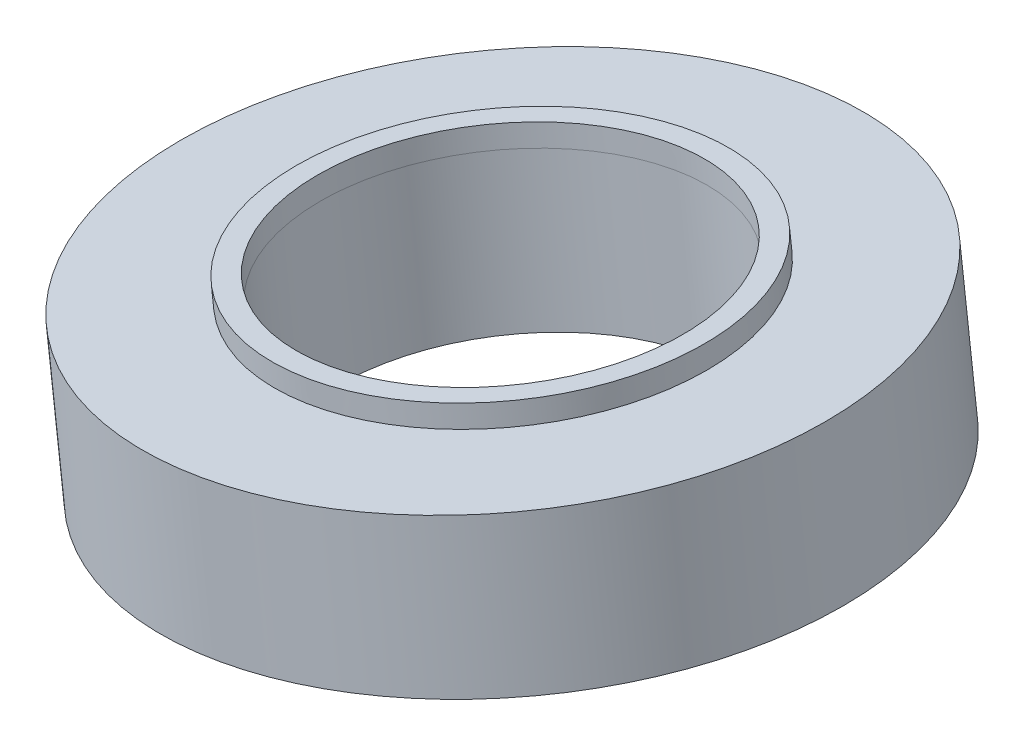
ISO-10303-21;
HEADER;
FILE_DESCRIPTION(('STEP AP214'),'2;1');
FILE_NAME('part.step','',(''),(''),'','','');
FILE_SCHEMA(('AUTOMOTIVE_DESIGN { 1 0 10303 214 1 1 1 1 }'));
ENDSEC;
DATA;
#1=APPLICATION_CONTEXT('core data for automotive mechanical design processes');
#2=APPLICATION_PROTOCOL_DEFINITION('international standard','automotive_design',2000,#1);
#3=PRODUCT_CONTEXT('',#1,'mechanical');
#4=PRODUCT('Part','Part','',(#3));
#5=PRODUCT_RELATED_PRODUCT_CATEGORY('part','',(#4));
#6=PRODUCT_DEFINITION_FORMATION('','',#4);
#7=PRODUCT_DEFINITION_CONTEXT('part definition',#1,'design');
#8=PRODUCT_DEFINITION('design','',#6,#7);
#9=PRODUCT_DEFINITION_SHAPE('','',#8);
#10=(LENGTH_UNIT() NAMED_UNIT(*) SI_UNIT(.MILLI.,.METRE.));
#11=(NAMED_UNIT(*) PLANE_ANGLE_UNIT() SI_UNIT($,.RADIAN.));
#12=(NAMED_UNIT(*) SI_UNIT($,.STERADIAN.) SOLID_ANGLE_UNIT());
#13=UNCERTAINTY_MEASURE_WITH_UNIT(LENGTH_MEASURE(1.E-05),#10,'distance_accuracy_value','');
#14=(GEOMETRIC_REPRESENTATION_CONTEXT(3) GLOBAL_UNCERTAINTY_ASSIGNED_CONTEXT((#13)) GLOBAL_UNIT_ASSIGNED_CONTEXT((#10,
#11,#12)) REPRESENTATION_CONTEXT('',''));
#15=CARTESIAN_POINT('',(0.,0.,0.));
#16=DIRECTION('',(0.,0.,1.));
#17=DIRECTION('',(1.,0.,0.));
#18=AXIS2_PLACEMENT_3D('',#15,#16,#17);
#19=CARTESIAN_POINT('',(-3524.60956869135,-384.822588668707,0.));
#20=DIRECTION('',(0.120137002673969,-0.992757322102695,0.));
#21=DIRECTION('',(0.992757322102695,0.120137002673969,0.));
#22=AXIS2_PLACEMENT_3D('',#19,#20,#21);
#23=CYLINDRICAL_SURFACE('',#22,8.50000058568555);
#24=CARTESIAN_POINT('',(-3523.76860950958,-391.771891270818,0.));
#25=DIRECTION('',(0.120136838804012,-0.992757341933153,0.));
#26=DIRECTION('',(0.992757341933153,0.120136838804012,0.));
#27=AXIS2_PLACEMENT_3D('',#24,#25,#26);
#28=CIRCLE('',#27,8.50000058568555);
#29=CARTESIAN_POINT('',(-3515.33017152171,-390.750728070622,0.));
#30=VERTEX_POINT('',#29);
#31=EDGE_CURVE('E20',#30,#30,#28,.T.);
#32=ORIENTED_EDGE('',*,*,#31,.T.);
#33=EDGE_LOOP('',(#32));
#34=FACE_BOUND('',#33,.T.);
#35=CARTESIAN_POINT('',(-3533.04800598788,-385.843753300196,0.));
#36=CARTESIAN_POINT('',(-3533.04800892557,-385.843753581874,0.139081058655098));
#37=CARTESIAN_POINT('',(-3533.04461727335,-385.843343075886,0.278161866272447));
#38=CARTESIAN_POINT('',(-3533.03106581932,-385.841703033499,0.555988557934667));
#39=CARTESIAN_POINT('',(-3533.0209060175,-385.840473497099,0.694734441979538));
#40=CARTESIAN_POINT('',(-3532.99383929446,-385.837197938804,0.971556864999831));
#41=CARTESIAN_POINT('',(-3532.97693237324,-385.835151916908,1.10963340397525));
#42=CARTESIAN_POINT('',(-3532.93641306495,-385.830248428219,1.38478454406801));
#43=CARTESIAN_POINT('',(-3532.91280067787,-385.827390961426,1.52185914518534));
#44=CARTESIAN_POINT('',(-3532.8589270748,-385.820871436715,1.79467617259968));
#45=CARTESIAN_POINT('',(-3532.82866585881,-385.817209378799,1.93041859889669));
#46=CARTESIAN_POINT('',(-3532.76156756614,-385.809089501908,2.20024426455565));
#47=CARTESIAN_POINT('',(-3532.72473048946,-385.804631682933,2.33432750391758));
#48=CARTESIAN_POINT('',(-3532.64456920141,-385.794931020877,2.60051177655997));
#49=CARTESIAN_POINT('',(-3532.60124499005,-385.789688177796,2.73261280984041));
#50=CARTESIAN_POINT('',(-3532.50821380924,-385.778430098396,2.99451442759531));
#51=CARTESIAN_POINT('',(-3532.45850683979,-385.772414862077,3.12431501206976));
#52=CARTESIAN_POINT('',(-3532.35282989,-385.759626487104,3.38130303117227));
#53=CARTESIAN_POINT('',(-3532.29685990966,-385.752853348449,3.50849046580033));
#54=CARTESIAN_POINT('',(-3532.17879177503,-385.738565485753,3.75994577955678));
#55=CARTESIAN_POINT('',(-3532.11669362074,-385.731050761713,3.88421365868517));
#56=CARTESIAN_POINT('',(-3531.98651873804,-385.715297831688,4.12953048923208));
#57=CARTESIAN_POINT('',(-3531.91844200962,-385.707059625704,4.25057944065061));
#58=CARTESIAN_POINT('',(-3531.77647398152,-385.689879578179,4.48916679825294));
#59=CARTESIAN_POINT('',(-3531.70258268183,-385.680937736639,4.60670520443674));
#60=CARTESIAN_POINT('',(-3531.54916352181,-385.662371959506,4.83798831125315));
#61=CARTESIAN_POINT('',(-3531.46963566147,-385.652748023912,4.95173301188575));
#62=CARTESIAN_POINT('',(-3531.30513496975,-385.632841243402,5.17515468665333));
#63=CARTESIAN_POINT('',(-3531.22016213836,-385.622558398485,5.28483166078832));
#64=CARTESIAN_POINT('',(-3531.04497621157,-385.601358571426,5.49985366112339));
#65=CARTESIAN_POINT('',(-3530.95476311615,-385.590441589284,5.60519868732348));
#66=CARTESIAN_POINT('',(-3530.76931399257,-385.567999787565,5.81130300639362));
#67=CARTESIAN_POINT('',(-3530.67407796439,-385.556474967988,5.91206229926368));
#68=CARTESIAN_POINT('',(-3530.47881240724,-385.532845255525,6.10875241371127));
#69=CARTESIAN_POINT('',(-3530.37878287826,-385.520740362639,6.20468323528881));
#70=CARTESIAN_POINT('',(-3530.17417129941,-385.495979665128,6.39148530140061));
#71=CARTESIAN_POINT('',(-3530.06958924955,-385.483323860504,6.48235654593488));
#72=CARTESIAN_POINT('',(-3529.85612457626,-385.457491828285,6.65882054117157));
#73=CARTESIAN_POINT('',(-3529.74724195285,-385.444315600689,6.74441329187398));
#74=CARTESIAN_POINT('',(-3529.52543844027,-385.417474465038,6.91011409901456));
#75=CARTESIAN_POINT('',(-3529.4125175511,-385.403809556983,6.99022215545274));
#76=CARTESIAN_POINT('',(-3529.18290954336,-385.376023980197,7.14476058673884));
#77=CARTESIAN_POINT('',(-3529.06622242477,-385.361903311467,7.21919096158677));
#78=CARTESIAN_POINT('',(-3528.82936306771,-385.333240231083,7.36219472040139));
#79=CARTESIAN_POINT('',(-3528.70919082922,-385.31869781943,7.43076810436809));
#80=CARTESIAN_POINT('',(-3528.46565073781,-385.28922628697,7.56189268213161));
#81=CARTESIAN_POINT('',(-3528.34228288489,-385.274297166163,7.62444387592845));
#82=CARTESIAN_POINT('',(-3528.09264876859,-385.244088180779,7.74337338204704));
#83=CARTESIAN_POINT('',(-3527.96638250522,-385.228808316202,7.7997516943688));
#84=CARTESIAN_POINT('',(-3527.71125575452,-385.197934653635,7.90619961724524));
#85=CARTESIAN_POINT('',(-3527.58239526721,-385.182340855645,7.95626922779992));
#86=CARTESIAN_POINT('',(-3527.32239050486,-385.150876892901,8.04997912506421));
#87=CARTESIAN_POINT('',(-3527.19124622982,-385.135006728148,8.09361941177381));
#88=CARTESIAN_POINT('',(-3526.92698983009,-385.10302826432,8.17436552807581));
#89=CARTESIAN_POINT('',(-3526.7938777054,-385.086919965246,8.2114713576682));
#90=CARTESIAN_POINT('',(-3526.52600628516,-385.054504038903,8.27905916854124));
#91=CARTESIAN_POINT('',(-3526.3912469896,-385.038196411635,8.30954114982189));
#92=CARTESIAN_POINT('',(-3526.1204058746,-385.005421115233,8.36380783030907));
#93=CARTESIAN_POINT('',(-3525.98432405515,-384.9889534461,8.38759252951558));
#94=CARTESIAN_POINT('',(-3525.71116572539,-384.955897737848,8.42840734643072));
#95=CARTESIAN_POINT('',(-3525.57408921509,-384.939309698729,8.44543746413937));
#96=CARTESIAN_POINT('',(-3525.29927173296,-384.906053212373,8.47270209101365));
#97=CARTESIAN_POINT('',(-3525.16153076115,-384.889384765135,8.48293660017928));
#98=CARTESIAN_POINT('',(-3524.88571618609,-384.856007618113,8.49658535413803));
#99=CARTESIAN_POINT('',(-3524.74764258285,-384.839298918328,8.49999959893114));
#100=CARTESIAN_POINT('',(-3524.47149537636,-384.80588151876,8.49999959893114));
#101=CARTESIAN_POINT('',(-3524.33342177312,-384.789172818976,8.49658535413803));
#102=CARTESIAN_POINT('',(-3524.05760719806,-384.755795671954,8.48293660017927));
#103=CARTESIAN_POINT('',(-3523.91986622624,-384.739127224716,8.47270209101362));
#104=CARTESIAN_POINT('',(-3523.64504874412,-384.705870738359,8.4454374641394));
#105=CARTESIAN_POINT('',(-3523.50797223382,-384.689282699241,8.42840734643084));
#106=CARTESIAN_POINT('',(-3523.23481390406,-384.656226990989,8.3875925295155));
#107=CARTESIAN_POINT('',(-3523.09873208461,-384.639759321855,8.36380783030873));
#108=CARTESIAN_POINT('',(-3522.8278909696,-384.606984025453,8.30954114982128));
#109=CARTESIAN_POINT('',(-3522.69313167405,-384.590676398185,8.27905916854061));
#110=CARTESIAN_POINT('',(-3522.42526025381,-384.558260471843,8.21147135766802));
#111=CARTESIAN_POINT('',(-3522.29214812912,-384.542152172768,8.17436552807611));
#112=CARTESIAN_POINT('',(-3522.02789172939,-384.51017370894,8.09361941177428));
#113=CARTESIAN_POINT('',(-3521.89674745435,-384.494303544187,8.04997912506435));
#114=CARTESIAN_POINT('',(-3521.636742692,-384.462839581444,7.95626922779984));
#115=CARTESIAN_POINT('',(-3521.50788220468,-384.447245783454,7.90619961724526));
#116=CARTESIAN_POINT('',(-3521.25275545399,-384.416372120887,7.79975169436883));
#117=CARTESIAN_POINT('',(-3521.12648919062,-384.40109225631,7.74337338204697));
#118=CARTESIAN_POINT('',(-3520.87685507432,-384.370883270925,7.62444387592849));
#119=CARTESIAN_POINT('',(-3520.7534872214,-384.355954150118,7.56189268213187));
#120=CARTESIAN_POINT('',(-3520.50994712999,-384.326482617658,7.43076810436859));
#121=CARTESIAN_POINT('',(-3520.3897748915,-384.311940206005,7.36219472040194));
#122=CARTESIAN_POINT('',(-3520.15291553443,-384.283277125622,7.21919096158693));
#123=CARTESIAN_POINT('',(-3520.03622841585,-384.269156456892,7.14476058673858));
#124=CARTESIAN_POINT('',(-3519.80662040811,-384.241370880106,6.99022215545231));
#125=CARTESIAN_POINT('',(-3519.69369951894,-384.22770597205,6.9101140990144));
#126=CARTESIAN_POINT('',(-3519.47189600636,-384.200864836399,6.74441329187421));
#127=CARTESIAN_POINT('',(-3519.36301338295,-384.187688608804,6.65882054117192));
#128=CARTESIAN_POINT('',(-3519.14954870966,-384.161856576584,6.48235654593521));
#129=CARTESIAN_POINT('',(-3519.0449666598,-384.14920077196,6.39148530140079));
#130=CARTESIAN_POINT('',(-3518.84035508095,-384.12444007445,6.20468323528862));
#131=CARTESIAN_POINT('',(-3518.74032555197,-384.112335181564,6.10875241371086));
#132=CARTESIAN_POINT('',(-3518.54505999482,-384.088705469101,5.91206229926334));
#133=CARTESIAN_POINT('',(-3518.44982396664,-384.077180649524,5.81130300639357));
#134=CARTESIAN_POINT('',(-3518.26437484306,-384.054738847805,5.60519868732362));
#135=CARTESIAN_POINT('',(-3518.17416174764,-384.043821865663,5.49985366112345));
#136=CARTESIAN_POINT('',(-3517.99897582085,-384.022622038603,5.28483166078833));
#137=CARTESIAN_POINT('',(-3517.91400298946,-384.012339193686,5.17515468665339));
#138=CARTESIAN_POINT('',(-3517.74950229774,-383.992432413176,4.95173301188563));
#139=CARTESIAN_POINT('',(-3517.6699744374,-383.982808477583,4.83798831125282));
#140=CARTESIAN_POINT('',(-3517.51655527738,-383.96424270045,4.60670520443654));
#141=CARTESIAN_POINT('',(-3517.44266397769,-383.955300858909,4.48916679825308));
#142=CARTESIAN_POINT('',(-3517.30069594958,-383.938120811385,4.2505794406509));
#143=CARTESIAN_POINT('',(-3517.23261922117,-383.929882605401,4.12953048923218));
#144=CARTESIAN_POINT('',(-3517.10244433847,-383.914129675376,3.88421365868514));
#145=CARTESIAN_POINT('',(-3517.04034618418,-383.906614951335,3.75994577955682));
#146=CARTESIAN_POINT('',(-3516.92227804955,-383.89232708864,3.50849046580035));
#147=CARTESIAN_POINT('',(-3516.86630806921,-383.885553949985,3.38130303117221));
#148=CARTESIAN_POINT('',(-3516.76063111942,-383.872765575011,3.12431501206976));
#149=CARTESIAN_POINT('',(-3516.71092414997,-383.866750338692,2.99451442759545));
#150=CARTESIAN_POINT('',(-3516.61789296916,-383.855492259292,2.73261280984058));
#151=CARTESIAN_POINT('',(-3516.5745687578,-383.850249416211,2.60051177656002));
#152=CARTESIAN_POINT('',(-3516.49440746975,-383.840548754155,2.3343275039175));
#153=CARTESIAN_POINT('',(-3516.45757039307,-383.836090935181,2.20024426455554));
#154=CARTESIAN_POINT('',(-3516.3904721004,-383.82797105829,1.93041859889662));
#155=CARTESIAN_POINT('',(-3516.36021088441,-383.824309000373,1.79467617259966));
#156=CARTESIAN_POINT('',(-3516.30633728134,-383.817789475663,1.52185914518539));
#157=CARTESIAN_POINT('',(-3516.28272489426,-383.814932008869,1.38478454406808));
#158=CARTESIAN_POINT('',(-3516.24220558597,-383.81002852018,1.10963340397529));
#159=CARTESIAN_POINT('',(-3516.22529866475,-383.807982498285,0.971556864999813));
#160=CARTESIAN_POINT('',(-3516.19823194171,-383.80470693999,0.694734441979478));
#161=CARTESIAN_POINT('',(-3516.18807213989,-383.80347740359,0.555988557934624));
#162=CARTESIAN_POINT('',(-3516.17452068586,-383.801837361203,0.278161866272439));
#163=CARTESIAN_POINT('',(-3516.17112903364,-383.801426855215,0.13908105865511));
#164=CARTESIAN_POINT('',(-3516.17113197133,-383.801427136893,0.));
#165=B_SPLINE_CURVE_WITH_KNOTS('',3,(#35,#36,#37,#38,#39,#40,#41,#42,#43,#44,#45,#46,#47,#48,
#49,#50,#51,#52,#53,#54,#55,#56,#57,#58,#59,#60,#61,#62,#63,#64,#65,#66,#67,#68,#69,#70,#71,#72,
#73,#74,#75,#76,#77,#78,#79,#80,#81,#82,#83,#84,#85,#86,#87,#88,#89,#90,#91,#92,#93,#94,#95,#96,
#97,#98,#99,#100,#101,#102,#103,#104,#105,#106,#107,#108,#109,#110,#111,#112,#113,#114,#115,
#116,#117,#118,#119,#120,#121,#122,#123,#124,#125,#126,#127,#128,#129,#130,#131,#132,#133,#134,
#135,#136,#137,#138,#139,#140,#141,#142,#143,#144,#145,#146,#147,#148,#149,#150,#151,#152,#153,
#154,#155,#156,#157,#158,#159,#160,#161,#162,#163,#164),.UNSPECIFIED.,.F.,.F.,(4,2,2,2,2,2,2,2,
2,2,2,2,2,2,2,2,2,2,2,2,2,2,2,2,2,2,2,2,2,2,2,2,2,2,2,2,2,2,2,2,2,2,2,2,2,2,2,2,2,2,2,2,2,2,2,2,
2,2,2,2,2,2,2,2,4),(0.,0.417200865204141,0.834401730408271,1.25160259561239,1.66880346081661,
2.08600432602076,2.50320519122488,2.92040605642895,3.33760692163317,3.7548077868373,
4.17200865204146,4.58920951724558,5.00641038244964,5.4236112476537,5.84081211285801,
6.25801297806218,6.67521384326621,7.09241470847038,7.50961557367441,7.92681643887883,
8.34401730408291,8.76121816928689,9.17841903449096,9.59561989969496,10.0128207648994,
10.4300216301036,10.8472224953076,11.2644233605116,11.6816242257156,12.0988250909204,
12.5160259561242,12.9332268213282,13.3504276865324,13.7676285517366,14.1848294169411,
14.6020302821449,15.0192311473489,15.4364320125533,15.8536328777572,16.2708337429616,
16.6880346081659,17.1052354733699,17.5224363385737,17.9396372037778,18.3568380689822,
18.7740389341864,19.1912397993906,19.6084406645946,20.0256415297986,20.442842395003,
20.8600432602072,21.2772441254113,21.6944449906152,22.1116458558194,22.5288467210237,
22.9460475862279,23.3632484514318,23.780449316636,24.1976501818401,24.6148510470444,
25.0320519122485,25.4492527774526,25.8664536426568,26.2836545078609,26.700855373065),.UNSPECIFIED.);
#166=CARTESIAN_POINT('',(-3533.04800647773,-385.843753334059,0.));
#167=VERTEX_POINT('',#166);
#168=CARTESIAN_POINT('',(-3516.17113125005,-383.801427049608,0.));
#169=VERTEX_POINT('',#168);
#170=EDGE_CURVE('E32',#167,#169,#165,.T.);
#171=ORIENTED_EDGE('',*,*,#170,.T.);
#172=CARTESIAN_POINT('',(-3516.17113099769,-383.80142701907,0.));
#173=CARTESIAN_POINT('',(-3516.17112806,-383.801426737393,-0.139081074702492));
#174=CARTESIAN_POINT('',(-3516.17451971261,-383.801837243428,-0.278161898367212));
#175=CARTESIAN_POINT('',(-3516.18807116821,-383.803477286004,-0.555988622085533));
#176=CARTESIAN_POINT('',(-3516.1982309712,-383.804706822546,-0.694734522139133));
#177=CARTESIAN_POINT('',(-3516.22529769736,-383.807982381219,-0.971556977099657));
#178=CARTESIAN_POINT('',(-3516.24220462053,-383.81002840335,-1.10963353200658));
#179=CARTESIAN_POINT('',(-3516.2827239335,-383.814931892605,-1.38478470384679));
#180=CARTESIAN_POINT('',(-3516.3063363233,-383.817789359728,-1.52185932078007));
#181=CARTESIAN_POINT('',(-3516.36020993258,-383.824308885191,-1.79467637967243));
#182=CARTESIAN_POINT('',(-3516.39047115206,-383.82797094353,-1.9304188216315));
#183=CARTESIAN_POINT('',(-3516.45756945248,-383.836090821358,-2.20024451842349));
#184=CARTESIAN_POINT('',(-3516.49440653341,-383.840548640847,-2.3343277732564));
#185=CARTESIAN_POINT('',(-3516.5745678307,-383.850249304022,-2.60051207661174));
#186=CARTESIAN_POINT('',(-3516.61789204707,-383.855492147708,-2.73261312513416));
#187=CARTESIAN_POINT('',(-3516.71092323861,-383.866750228407,-2.9945147731077));
#188=CARTESIAN_POINT('',(-3516.76063021379,-383.87276546542,-3.12431537255881));
#189=CARTESIAN_POINT('',(-3516.86630717578,-383.885553841869,-3.38130342131307));
#190=CARTESIAN_POINT('',(-3516.92227716258,-383.892326981305,-3.50849087061622));
#191=CARTESIAN_POINT('',(-3517.04034531083,-383.906614845649,-3.75994621338603));
#192=CARTESIAN_POINT('',(-3517.10244347228,-383.914129570557,-3.8842141068527));
#193=CARTESIAN_POINT('',(-3517.23261837001,-383.929882502399,-4.12953096570486));
#194=CARTESIAN_POINT('',(-3517.30069510627,-383.938120709334,-4.25057993109036));
#195=CARTESIAN_POINT('',(-3517.44266315076,-383.955300758841,-4.48916731622152));
#196=CARTESIAN_POINT('',(-3517.51655445897,-383.964242601413,-4.60670573596719));
#197=CARTESIAN_POINT('',(-3517.6699736367,-383.982808380688,-4.83798886946942));
#198=CARTESIAN_POINT('',(-3517.74950150621,-383.992432317392,-4.95173358322598));
#199=CARTESIAN_POINT('',(-3517.91400221692,-384.012339100199,-5.17515528377248));
#200=CARTESIAN_POINT('',(-3517.9989750581,-384.022621946302,-5.28483227056242));
#201=CARTESIAN_POINT('',(-3518.17416100511,-384.043821775807,-5.49985429570731));
#202=CARTESIAN_POINT('',(-3518.26437411093,-384.054738759209,-5.60519933406226));
#203=CARTESIAN_POINT('',(-3518.44982325592,-384.077180563517,-5.81130367691312));
#204=CARTESIAN_POINT('',(-3518.54505929508,-384.088705384424,-5.91206298140903));
#205=CARTESIAN_POINT('',(-3518.74032487476,-384.112335099613,-6.10875311855154));
#206=CARTESIAN_POINT('',(-3518.84035441529,-384.124439993896,-6.20468395119814));
#207=CARTESIAN_POINT('',(-3519.04496601774,-384.149200694264,-6.39148603886364));
#208=CARTESIAN_POINT('',(-3519.14954807968,-384.161856500348,-6.48235729388254));
#209=CARTESIAN_POINT('',(-3519.36301277759,-384.187688535548,-6.65882130947989));
#210=CARTESIAN_POINT('',(-3519.47189541357,-384.200864764664,-6.74441407005833));
#211=CARTESIAN_POINT('',(-3519.69369895174,-384.227705903411,-6.91011489631773));
#212=CARTESIAN_POINT('',(-3519.80661985393,-384.241370813043,-6.99022296199868));
#213=CARTESIAN_POINT('',(-3520.03622788817,-384.269156393035,-7.14476141111617));
#214=CARTESIAN_POINT('',(-3520.15291502022,-384.283277063395,-7.2191917945527));
#215=CARTESIAN_POINT('',(-3520.38977440461,-384.311940147085,-7.36219556986796));
#216=CARTESIAN_POINT('',(-3520.50994665697,-384.326482560416,-7.43076896174667));
#217=CARTESIAN_POINT('',(-3520.75348677648,-384.355954096277,-7.56189355463935));
#218=CARTESIAN_POINT('',(-3520.87685464363,-384.370883218807,-7.62444475565331));
#219=CARTESIAN_POINT('',(-3521.12648878873,-384.401092207676,-7.7433742754941));
#220=CARTESIAN_POINT('',(-3521.25275506668,-384.416372074016,-7.79975259432093));
#221=CARTESIAN_POINT('',(-3521.5078818468,-384.447245740146,-7.90620052947967));
#222=CARTESIAN_POINT('',(-3521.63674234899,-384.462839539935,-7.95627014581159));
#223=CARTESIAN_POINT('',(-3521.89674714134,-384.494303506309,-8.04998005388889));
#224=CARTESIAN_POINT('',(-3522.02789143151,-384.510173672893,-8.09362034563428));
#225=CARTESIAN_POINT('',(-3522.29214786173,-384.542152140411,-8.17436647125305));
#226=CARTESIAN_POINT('',(-3522.42526000177,-384.558260441344,-8.21147230512645));
#227=CARTESIAN_POINT('',(-3522.69313145293,-384.590676371426,-8.2790601237977));
#228=CARTESIAN_POINT('',(-3522.82789076403,-384.606984000576,-8.30954210859556));
#229=CARTESIAN_POINT('',(-3523.09873191029,-384.639759300759,-8.36380879534413));
#230=CARTESIAN_POINT('',(-3523.23481374544,-384.656226971794,-8.38759349729482));
#231=CARTESIAN_POINT('',(-3523.50797210671,-384.68928268386,-8.42840831891966));
#232=CARTESIAN_POINT('',(-3523.64504863283,-384.705870724892,-8.44543843859379));
#233=CARTESIAN_POINT('',(-3523.91986614666,-384.739127215085,-8.47270306861421));
#234=CARTESIAN_POINT('',(-3524.05760713437,-384.755795664246,-8.48293757896051));
#235=CARTESIAN_POINT('',(-3524.33342174126,-384.78917281512,-8.49658633449423));
#236=CARTESIAN_POINT('',(-3524.47149536043,-384.805881516832,-8.50000057968166));
#237=CARTESIAN_POINT('',(-3524.74764259878,-384.839298920256,-8.50000057968166));
#238=CARTESIAN_POINT('',(-3524.88571621795,-384.856007621968,-8.49658633449424));
#239=CARTESIAN_POINT('',(-3525.16153082483,-384.889384772841,-8.48293757896051));
#240=CARTESIAN_POINT('',(-3525.29927181254,-384.906053222003,-8.47270306861419));
#241=CARTESIAN_POINT('',(-3525.57408932637,-384.939309712196,-8.44543843859471));
#242=CARTESIAN_POINT('',(-3525.7111658525,-384.955897753228,-8.42840831892153));
#243=CARTESIAN_POINT('',(-3525.98432421377,-384.988953465294,-8.38759349729738));
#244=CARTESIAN_POINT('',(-3526.12040604892,-385.005421136328,-8.36380879534641));
#245=CARTESIAN_POINT('',(-3526.39124719518,-385.038196436512,-8.30954210859765));
#246=CARTESIAN_POINT('',(-3526.52600650628,-385.054504065661,-8.27906012379986));
#247=CARTESIAN_POINT('',(-3526.79387795743,-385.086919995744,-8.2114723051286));
#248=CARTESIAN_POINT('',(-3526.92699009748,-385.103028296677,-8.17436647125513));
#249=CARTESIAN_POINT('',(-3527.1912465277,-385.135006764195,-8.09362034563655));
#250=CARTESIAN_POINT('',(-3527.32239081787,-385.150876930779,-8.04998005389145));
#251=CARTESIAN_POINT('',(-3527.58239561022,-385.182340897153,-7.95627014581485));
#252=CARTESIAN_POINT('',(-3527.71125611241,-385.197934696942,-7.90620052948335));
#253=CARTESIAN_POINT('',(-3527.96638289253,-385.228808363071,-7.79975259432479));
#254=CARTESIAN_POINT('',(-3528.09264917048,-385.244088229412,-7.74337427549774));
#255=CARTESIAN_POINT('',(-3528.34228331558,-385.274297218281,-7.62444475565683));
#256=CARTESIAN_POINT('',(-3528.46565118273,-385.289226340811,-7.56189355464297));
#257=CARTESIAN_POINT('',(-3528.70919130225,-385.318697876671,-7.43076896175021));
#258=CARTESIAN_POINT('',(-3528.8293635546,-385.333240290002,-7.36219556987131));
#259=CARTESIAN_POINT('',(-3529.06622293899,-385.361903373693,-7.2191917945562));
#260=CARTESIAN_POINT('',(-3529.18291007104,-385.376024044053,-7.14476141111998));
#261=CARTESIAN_POINT('',(-3529.41251810528,-385.403809624045,-6.99022296200307));
#262=CARTESIAN_POINT('',(-3529.52543900747,-385.417474533677,-6.91011489632238));
#263=CARTESIAN_POINT('',(-3529.74724254565,-385.444315672424,-6.74441407006306));
#264=CARTESIAN_POINT('',(-3529.85612518162,-385.45749190154,-6.65882130948445));
#265=CARTESIAN_POINT('',(-3530.06958987954,-385.48332393674,-6.48235729388689));
#266=CARTESIAN_POINT('',(-3530.17417194147,-385.495979742824,-6.39148603886796));
#267=CARTESIAN_POINT('',(-3530.37878354393,-385.520740443192,-6.20468395120253));
#268=CARTESIAN_POINT('',(-3530.47881308445,-385.532845337475,-6.10875311855604));
#269=CARTESIAN_POINT('',(-3530.67407866413,-385.556475052664,-5.91206298141389));
#270=CARTESIAN_POINT('',(-3530.76931470329,-385.567999873571,-5.81130367691823));
#271=CARTESIAN_POINT('',(-3530.95476384828,-385.590441677879,-5.6051993340674));
#272=CARTESIAN_POINT('',(-3531.0449769541,-385.601358661281,-5.49985429571222));
#273=CARTESIAN_POINT('',(-3531.22016290111,-385.622558490786,-5.2848322705672));
#274=CARTESIAN_POINT('',(-3531.3051357423,-385.63284133689,-5.17515528377736));
#275=CARTESIAN_POINT('',(-3531.469636453,-385.652748119697,-4.9517335832307));
#276=CARTESIAN_POINT('',(-3531.54916432252,-385.6623720564,-4.83798886947387));
#277=CARTESIAN_POINT('',(-3531.70258350025,-385.680937835676,-4.60670573597164));
#278=CARTESIAN_POINT('',(-3531.77647480846,-385.689879678248,-4.48916731622624));
#279=CARTESIAN_POINT('',(-3531.91844285294,-385.707059727755,-4.25057993109531));
#280=CARTESIAN_POINT('',(-3531.98651958921,-385.71529793469,-4.12953096570978));
#281=CARTESIAN_POINT('',(-3532.11669448693,-385.731050866532,-3.88421410685743));
#282=CARTESIAN_POINT('',(-3532.17879264839,-385.73856559144,-3.7599462133906));
#283=CARTESIAN_POINT('',(-3532.29686079664,-385.752853455784,-3.50849087062045));
#284=CARTESIAN_POINT('',(-3532.35283078344,-385.75962659522,-3.38130342131711));
#285=CARTESIAN_POINT('',(-3532.45850774542,-385.772414971669,-3.12431537256268));
#286=CARTESIAN_POINT('',(-3532.50821472061,-385.778430208682,-2.99451477311159));
#287=CARTESIAN_POINT('',(-3532.60124591215,-385.789688289381,-2.73261312513781));
#288=CARTESIAN_POINT('',(-3532.64457012852,-385.794931133067,-2.60051207661512));
#289=CARTESIAN_POINT('',(-3532.72473142581,-385.804631796242,-2.33432777325949));
#290=CARTESIAN_POINT('',(-3532.76156850674,-385.809089615731,-2.20024451842655));
#291=CARTESIAN_POINT('',(-3532.82866680716,-385.817209493559,-1.9304188216343));
#292=CARTESIAN_POINT('',(-3532.85892802664,-385.820871551898,-1.794676379675));
#293=CARTESIAN_POINT('',(-3532.91280163592,-385.827391077361,-1.52185932078221));
#294=CARTESIAN_POINT('',(-3532.93641402572,-385.830248544484,-1.38478470384873));
#295=CARTESIAN_POINT('',(-3532.97693333869,-385.835152033739,-1.10963353200818));
#296=CARTESIAN_POINT('',(-3532.99384026186,-385.83719805587,-0.971556977101105));
#297=CARTESIAN_POINT('',(-3533.02090698802,-385.840473614543,-0.694734522140213));
#298=CARTESIAN_POINT('',(-3533.03106679101,-385.841703151085,-0.555988622086392));
#299=CARTESIAN_POINT('',(-3533.04461824661,-385.843343193661,-0.27816189836763));
#300=CARTESIAN_POINT('',(-3533.04800989922,-385.843753699696,-0.139081074702689));
#301=CARTESIAN_POINT('',(-3533.04800696153,-385.843753418019,0.));
#302=B_SPLINE_CURVE_WITH_KNOTS('',3,(#172,#173,#174,#175,#176,#177,#178,#179,#180,#181,#182,
#183,#184,#185,#186,#187,#188,#189,#190,#191,#192,#193,#194,#195,#196,#197,#198,#199,#200,#201,
#202,#203,#204,#205,#206,#207,#208,#209,#210,#211,#212,#213,#214,#215,#216,#217,#218,#219,#220,
#221,#222,#223,#224,#225,#226,#227,#228,#229,#230,#231,#232,#233,#234,#235,#236,#237,#238,#239,
#240,#241,#242,#243,#244,#245,#246,#247,#248,#249,#250,#251,#252,#253,#254,#255,#256,#257,#258,
#259,#260,#261,#262,#263,#264,#265,#266,#267,#268,#269,#270,#271,#272,#273,#274,#275,#276,#277,
#278,#279,#280,#281,#282,#283,#284,#285,#286,#287,#288,#289,#290,#291,#292,#293,#294,#295,#296,
#297,#298,#299,#300,#301),.UNSPECIFIED.,.F.,.F.,(4,2,2,2,2,2,2,2,2,2,2,2,2,2,2,2,2,2,2,2,2,2,2,
2,2,2,2,2,2,2,2,2,2,2,2,2,2,2,2,2,2,2,2,2,2,2,2,2,2,2,2,2,2,2,2,2,2,2,2,2,2,2,2,2,4),(0.,
0.417200913341458,0.834401826682894,1.25160274002436,1.66880365336581,2.08600456670733,
2.50320548004889,2.92040639339041,3.33760730673192,3.75480822007338,4.17200913341473,
4.5892100467566,5.00641096009797,5.42361187343965,5.84081278678119,6.25801370012267,
6.67521461346435,7.09241552680617,7.50961644014749,7.92681735348916,8.34401826683106,
8.7612191801726,9.17842009351423,9.59562100685567,10.0128219201976,10.4300228335394,
10.8472237468813,11.2644246602228,11.6816255735642,12.0988264869062,12.5160274002482,
12.9332283135899,13.3504292269314,13.7676301402729,14.1848310536147,14.6020319669569,
15.0192328802989,15.4364337936403,15.8536347069822,16.2708356203239,16.6880365336662,
17.1052374470078,17.5224383603496,17.9396392736913,18.3568401870333,18.7740411003756,
19.1912420137174,19.6084429270591,20.025643840401,20.4428447537433,20.8600456670853,
21.2772465804271,21.6944474937691,22.1116484071109,22.5288493204532,22.9460502337951,
23.3632511471372,23.7804520604792,24.1976529738212,24.6148538871633,25.0320548005054,
25.4492557138474,25.8664566271895,26.2836575405316,26.7008584538737),.UNSPECIFIED.);
#303=EDGE_CURVE('E35',#169,#167,#302,.T.);
#304=ORIENTED_EDGE('',*,*,#303,.T.);
#305=EDGE_LOOP('',(#171,#304));
#306=FACE_BOUND('',#305,.T.);
#307=ADVANCED_FACE('F17',(#34,#306),#23,.F.);
#308=CARTESIAN_POINT('',(-4.13270725499602,34.1508525636409,0.));
#309=DIRECTION('',(0.120136838804012,-0.992757341933153,0.));
#310=DIRECTION('',(0.992757341933153,0.120136838804012,0.));
#311=AXIS2_PLACEMENT_3D('',#308,#309,#310);
#312=PLANE('',#311);
#313=ORIENTED_EDGE('',*,*,#31,.F.);
#314=EDGE_LOOP('',(#313));
#315=FACE_BOUND('',#314,.T.);
#316=CARTESIAN_POINT('',(-3523.76860950958,-391.771891270818,0.));
#317=DIRECTION('',(0.120136838804012,-0.992757341933153,0.));
#318=DIRECTION('',(0.992757341933153,0.120136838804012,0.));
#319=AXIS2_PLACEMENT_3D('',#316,#317,#318);
#320=CIRCLE('',#319,14.9999998740924);
#321=CARTESIAN_POINT('',(-3508.87724950558,-389.969838703884,0.));
#322=VERTEX_POINT('',#321);
#323=EDGE_CURVE('E39',#322,#322,#320,.T.);
#324=ORIENTED_EDGE('',*,*,#323,.T.);
#325=EDGE_LOOP('',(#324));
#326=FACE_BOUND('',#325,.T.);
#327=ADVANCED_FACE('F77',(#315,#326),#312,.T.);
#328=CARTESIAN_POINT('',(-3524.60884730809,-384.828553831998,0.));
#329=DIRECTION('',(-0.120136017107467,0.992757441369016,0.));
#330=DIRECTION('',(-0.992757441369016,-0.120136017107467,0.));
#331=AXIS2_PLACEMENT_3D('',#328,#329,#330);
#332=CYLINDRICAL_SURFACE('',#331,8.50000009225296);
#333=ORIENTED_EDGE('',*,*,#303,.F.);
#334=ORIENTED_EDGE('',*,*,#170,.F.);
#335=EDGE_LOOP('',(#333,#334));
#336=FACE_BOUND('',#335,.T.);
#337=CARTESIAN_POINT('',(-3524.72970501438,-383.829832631212,0.));
#338=DIRECTION('',(-0.120136838804012,0.992757341933153,0.));
#339=DIRECTION('',(-0.992757341933153,-0.120136838804012,0.));
#340=AXIS2_PLACEMENT_3D('',#337,#338,#339);
#341=CIRCLE('',#340,8.50000009225296);
#342=CARTESIAN_POINT('',(-3533.16814251239,-384.850995772129,0.));
#343=VERTEX_POINT('',#342);
#344=EDGE_CURVE('E42',#343,#343,#341,.T.);
#345=ORIENTED_EDGE('',*,*,#344,.T.);
#346=EDGE_LOOP('',(#345));
#347=FACE_BOUND('',#346,.T.);
#348=ADVANCED_FACE('F37',(#336,#347),#332,.F.);
#349=CARTESIAN_POINT('',(-3524.60956880413,-384.822587736815,0.));
#350=DIRECTION('',(0.120137002673973,-0.992757322102695,0.));
#351=DIRECTION('',(0.992757322102695,0.120137002673973,0.));
#352=AXIS2_PLACEMENT_3D('',#349,#350,#351);
#353=CYLINDRICAL_SURFACE('',#352,14.9999998740924);
#354=ORIENTED_EDGE('',*,*,#323,.F.);
#355=EDGE_LOOP('',(#354));
#356=FACE_BOUND('',#355,.T.);
#357=CARTESIAN_POINT('',(-3524.60956852833,-384.822590015867,0.));
#358=DIRECTION('',(0.120136838804012,-0.992757341933153,0.));
#359=DIRECTION('',(0.992757341933153,0.120136838804012,0.));
#360=AXIS2_PLACEMENT_3D('',#357,#358,#359);
#361=CIRCLE('',#360,14.9999998740924);
#362=CARTESIAN_POINT('',(-3509.71820852433,-383.020537448933,0.));
#363=VERTEX_POINT('',#362);
#364=EDGE_CURVE('E112',#363,#363,#361,.T.);
#365=ORIENTED_EDGE('',*,*,#364,.T.);
#366=EDGE_LOOP('',(#365));
#367=FACE_BOUND('',#366,.T.);
#368=ADVANCED_FACE('F61',(#356,#367),#353,.T.);
#369=CARTESIAN_POINT('',(-5.09380196546021,42.0929112993714,0.));
#370=DIRECTION('',(-0.120136838804012,0.992757341933153,0.));
#371=DIRECTION('',(-0.992757341933153,-0.120136838804012,0.));
#372=AXIS2_PLACEMENT_3D('',#369,#370,#371);
#373=PLANE('',#372);
#374=ORIENTED_EDGE('',*,*,#344,.F.);
#375=EDGE_LOOP('',(#374));
#376=FACE_BOUND('',#375,.T.);
#377=CARTESIAN_POINT('',(-3524.72970501437,-383.829832631212,0.));
#378=DIRECTION('',(-0.120136838804012,0.992757341933153,0.));
#379=DIRECTION('',(-0.992757341933153,-0.120136838804012,0.));
#380=AXIS2_PLACEMENT_3D('',#377,#378,#379);
#381=CIRCLE('',#380,9.50000074395614);
#382=CARTESIAN_POINT('',(-3534.16090050131,-384.971132689226,0.));
#383=VERTEX_POINT('',#382);
#384=EDGE_CURVE('E26',#383,#383,#381,.T.);
#385=ORIENTED_EDGE('',*,*,#384,.T.);
#386=EDGE_LOOP('',(#385));
#387=FACE_BOUND('',#386,.T.);
#388=ADVANCED_FACE('F96',(#376,#387),#373,.T.);
#389=CARTESIAN_POINT('',(-4.97366512665219,41.1001539574051,0.));
#390=DIRECTION('',(0.120136838804012,-0.992757341933153,0.));
#391=DIRECTION('',(0.992757341933153,0.120136838804012,0.));
#392=AXIS2_PLACEMENT_3D('',#389,#390,#391);
#393=PLANE('',#392);
#394=CARTESIAN_POINT('',(-3524.60956899726,-384.822590072614,0.));
#395=DIRECTION('',(0.120136838804012,-0.992757341933153,0.));
#396=DIRECTION('',(0.992757341933153,0.120136838804012,0.));
#397=AXIS2_PLACEMENT_3D('',#394,#395,#396);
#398=CIRCLE('',#397,9.50000074395614);
#399=CARTESIAN_POINT('',(-3515.17837351033,-383.681290014599,0.));
#400=VERTEX_POINT('',#399);
#401=EDGE_CURVE('E11',#400,#400,#398,.T.);
#402=ORIENTED_EDGE('',*,*,#401,.T.);
#403=EDGE_LOOP('',(#402));
#404=FACE_BOUND('',#403,.T.);
#405=ORIENTED_EDGE('',*,*,#364,.F.);
#406=EDGE_LOOP('',(#405));
#407=FACE_BOUND('',#406,.T.);
#408=ADVANCED_FACE('F90',(#404,#407),#393,.F.);
#409=CARTESIAN_POINT('',(-3524.60884720736,-384.828554664344,0.));
#410=DIRECTION('',(-0.120136017107472,0.992757441369015,0.));
#411=DIRECTION('',(-0.992757441369015,-0.120136017107472,0.));
#412=AXIS2_PLACEMENT_3D('',#409,#410,#411);
#413=CYLINDRICAL_SURFACE('',#412,9.50000074395614);
#414=ORIENTED_EDGE('',*,*,#401,.F.);
#415=EDGE_LOOP('',(#414));
#416=FACE_BOUND('',#415,.T.);
#417=ORIENTED_EDGE('',*,*,#384,.F.);
#418=EDGE_LOOP('',(#417));
#419=FACE_BOUND('',#418,.T.);
#420=ADVANCED_FACE('F88',(#416,#419),#413,.T.);
#421=CLOSED_SHELL('',(#307,#327,#348,#368,#388,#408,#420));
#422=MANIFOLD_SOLID_BREP('B1',#421);
#423=ADVANCED_BREP_SHAPE_REPRESENTATION('',(#18,#422),#14);
#424=SHAPE_DEFINITION_REPRESENTATION(#9,#423);
ENDSEC;
END-ISO-10303-21;
